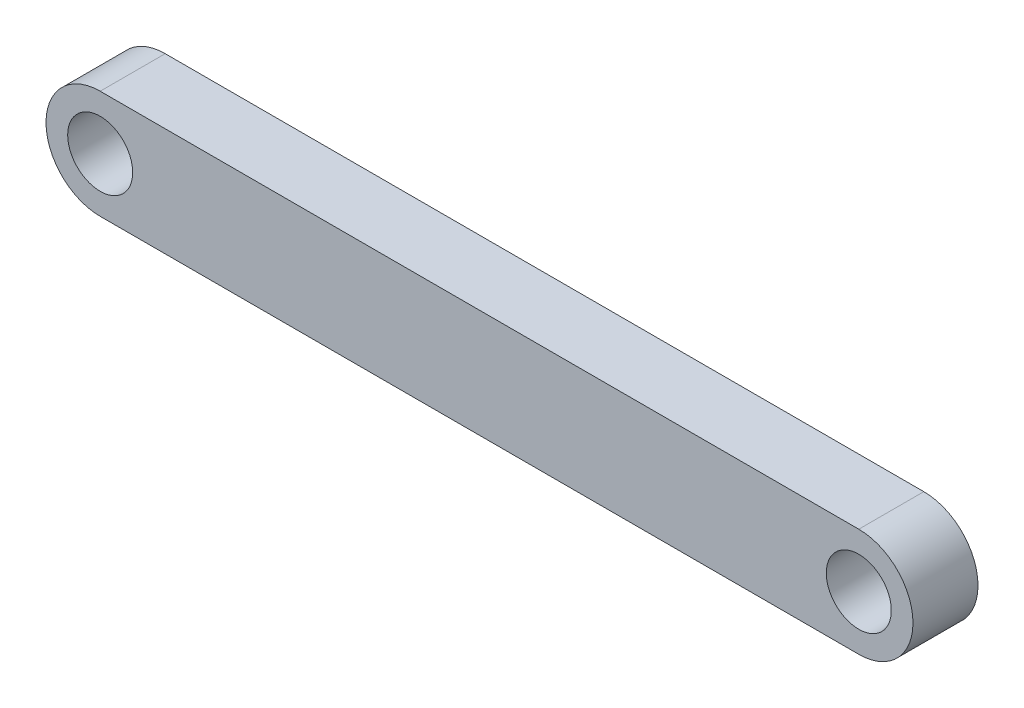
ISO-10303-21;
HEADER;
FILE_DESCRIPTION(('STEP AP214'),'2;1');
FILE_NAME('part.step','',(''),(''),'','','');
FILE_SCHEMA(('AUTOMOTIVE_DESIGN { 1 0 10303 214 1 1 1 1 }'));
ENDSEC;
DATA;
#1=APPLICATION_CONTEXT('core data for automotive mechanical design processes');
#2=APPLICATION_PROTOCOL_DEFINITION('international standard','automotive_design',2000,#1);
#3=PRODUCT_CONTEXT('',#1,'mechanical');
#4=PRODUCT('Part','Part','',(#3));
#5=PRODUCT_RELATED_PRODUCT_CATEGORY('part','',(#4));
#6=PRODUCT_DEFINITION_FORMATION('','',#4);
#7=PRODUCT_DEFINITION_CONTEXT('part definition',#1,'design');
#8=PRODUCT_DEFINITION('design','',#6,#7);
#9=PRODUCT_DEFINITION_SHAPE('','',#8);
#10=(LENGTH_UNIT() NAMED_UNIT(*) SI_UNIT(.MILLI.,.METRE.));
#11=(NAMED_UNIT(*) PLANE_ANGLE_UNIT() SI_UNIT($,.RADIAN.));
#12=(NAMED_UNIT(*) SI_UNIT($,.STERADIAN.) SOLID_ANGLE_UNIT());
#13=UNCERTAINTY_MEASURE_WITH_UNIT(LENGTH_MEASURE(1.E-05),#10,'distance_accuracy_value','');
#14=(GEOMETRIC_REPRESENTATION_CONTEXT(3) GLOBAL_UNCERTAINTY_ASSIGNED_CONTEXT((#13)) GLOBAL_UNIT_ASSIGNED_CONTEXT((#10,
#11,#12)) REPRESENTATION_CONTEXT('',''));
#15=CARTESIAN_POINT('',(0.,0.,0.));
#16=DIRECTION('',(0.,0.,1.));
#17=DIRECTION('',(1.,0.,0.));
#18=AXIS2_PLACEMENT_3D('',#15,#16,#17);
#19=CARTESIAN_POINT('',(70.,670.,9.00000000000001));
#20=DIRECTION('',(0.,0.,-1.));
#21=DIRECTION('',(-1.,0.,0.));
#22=AXIS2_PLACEMENT_3D('',#19,#20,#21);
#23=CYLINDRICAL_SURFACE('',#22,4.99999999999995);
#24=CARTESIAN_POINT('',(70.,670.,3.00000000000001));
#25=DIRECTION('',(0.,0.,-1.));
#26=DIRECTION('',(-1.,0.,0.));
#27=AXIS2_PLACEMENT_3D('',#24,#25,#26);
#28=CIRCLE('',#27,4.99999999999995);
#29=CARTESIAN_POINT('',(70.,675.,3.00000000000001));
#30=VERTEX_POINT('',#29);
#31=CARTESIAN_POINT('',(70.,665.,3.00000000000001));
#32=VERTEX_POINT('',#31);
#33=EDGE_CURVE('E103',#30,#32,#28,.T.);
#34=ORIENTED_EDGE('',*,*,#33,.F.);
#35=DIRECTION('',(0.,0.,-1.));
#36=VECTOR('',#35,1.);
#37=CARTESIAN_POINT('',(70.,675.,9.00000000000001));
#38=LINE('',#37,#36);
#39=CARTESIAN_POINT('',(70.,675.,9.00000000000001));
#40=VERTEX_POINT('',#39);
#41=EDGE_CURVE('E11',#40,#30,#38,.T.);
#42=ORIENTED_EDGE('',*,*,#41,.F.);
#43=CARTESIAN_POINT('',(70.,670.,9.00000000000001));
#44=DIRECTION('',(0.,0.,-1.));
#45=DIRECTION('',(-1.,0.,0.));
#46=AXIS2_PLACEMENT_3D('',#43,#44,#45);
#47=CIRCLE('',#46,4.99999999999995);
#48=CARTESIAN_POINT('',(70.,665.,9.00000000000001));
#49=VERTEX_POINT('',#48);
#50=EDGE_CURVE('E95',#40,#49,#47,.T.);
#51=ORIENTED_EDGE('',*,*,#50,.T.);
#52=DIRECTION('',(0.,0.,-1.));
#53=VECTOR('',#52,1.);
#54=CARTESIAN_POINT('',(70.,665.,9.00000000000001));
#55=LINE('',#54,#53);
#56=EDGE_CURVE('E42',#49,#32,#55,.T.);
#57=ORIENTED_EDGE('',*,*,#56,.T.);
#58=EDGE_LOOP('',(#34,#42,#51,#57));
#59=FACE_BOUND('',#58,.T.);
#60=ADVANCED_FACE('F39',(#59),#23,.T.);
#61=CARTESIAN_POINT('',(1.07057220231712E-12,675.,9.00000000000001));
#62=DIRECTION('',(0.,-1.,0.));
#63=DIRECTION('',(1.,0.,0.));
#64=AXIS2_PLACEMENT_3D('',#61,#62,#63);
#65=PLANE('',#64);
#66=DIRECTION('',(-1.,0.,0.));
#67=VECTOR('',#66,1.);
#68=CARTESIAN_POINT('',(1.07057220231712E-12,675.,3.00000000000001));
#69=LINE('',#68,#67);
#70=CARTESIAN_POINT('',(0.,675.,3.00000000000001));
#71=VERTEX_POINT('',#70);
#72=EDGE_CURVE('E110',#30,#71,#69,.T.);
#73=ORIENTED_EDGE('',*,*,#72,.T.);
#74=DIRECTION('',(0.,0.,-1.));
#75=VECTOR('',#74,1.);
#76=CARTESIAN_POINT('',(0.,675.,9.00000000000001));
#77=LINE('',#76,#75);
#78=CARTESIAN_POINT('',(0.,675.,9.00000000000001));
#79=VERTEX_POINT('',#78);
#80=EDGE_CURVE('E48',#79,#71,#77,.T.);
#81=ORIENTED_EDGE('',*,*,#80,.F.);
#82=DIRECTION('',(-1.,0.,0.));
#83=VECTOR('',#82,1.);
#84=CARTESIAN_POINT('',(1.07057220231712E-12,675.,9.00000000000001));
#85=LINE('',#84,#83);
#86=EDGE_CURVE('E98',#40,#79,#85,.T.);
#87=ORIENTED_EDGE('',*,*,#86,.F.);
#88=ORIENTED_EDGE('',*,*,#41,.T.);
#89=EDGE_LOOP('',(#73,#81,#87,#88));
#90=FACE_BOUND('',#89,.T.);
#91=ADVANCED_FACE('F141',(#90),#65,.F.);
#92=CARTESIAN_POINT('',(0.,670.,9.00000000000001));
#93=DIRECTION('',(0.,0.,-1.));
#94=DIRECTION('',(-1.,0.,0.));
#95=AXIS2_PLACEMENT_3D('',#92,#93,#94);
#96=CYLINDRICAL_SURFACE('',#95,5.);
#97=CARTESIAN_POINT('',(0.,670.,3.00000000000001));
#98=DIRECTION('',(0.,0.,-1.));
#99=DIRECTION('',(-1.,0.,0.));
#100=AXIS2_PLACEMENT_3D('',#97,#98,#99);
#101=CIRCLE('',#100,5.);
#102=CARTESIAN_POINT('',(0.,665.,3.00000000000001));
#103=VERTEX_POINT('',#102);
#104=EDGE_CURVE('E90',#103,#71,#101,.T.);
#105=ORIENTED_EDGE('',*,*,#104,.F.);
#106=DIRECTION('',(0.,0.,-1.));
#107=VECTOR('',#106,1.);
#108=CARTESIAN_POINT('',(0.,665.,9.00000000000001));
#109=LINE('',#108,#107);
#110=CARTESIAN_POINT('',(0.,665.,9.00000000000001));
#111=VERTEX_POINT('',#110);
#112=EDGE_CURVE('E86',#111,#103,#109,.T.);
#113=ORIENTED_EDGE('',*,*,#112,.F.);
#114=CARTESIAN_POINT('',(0.,670.,9.00000000000001));
#115=DIRECTION('',(0.,0.,-1.));
#116=DIRECTION('',(-1.,0.,0.));
#117=AXIS2_PLACEMENT_3D('',#114,#115,#116);
#118=CIRCLE('',#117,5.);
#119=EDGE_CURVE('E88',#111,#79,#118,.T.);
#120=ORIENTED_EDGE('',*,*,#119,.T.);
#121=ORIENTED_EDGE('',*,*,#80,.T.);
#122=EDGE_LOOP('',(#105,#113,#120,#121));
#123=FACE_BOUND('',#122,.T.);
#124=ADVANCED_FACE('F87',(#123),#96,.T.);
#125=CARTESIAN_POINT('',(0.,665.,9.00000000000001));
#126=DIRECTION('',(0.,1.,0.));
#127=DIRECTION('',(0.,0.,1.));
#128=AXIS2_PLACEMENT_3D('',#125,#126,#127);
#129=PLANE('',#128);
#130=DIRECTION('',(1.,0.,0.));
#131=VECTOR('',#130,1.);
#132=CARTESIAN_POINT('',(0.,665.,3.00000000000001));
#133=LINE('',#132,#131);
#134=EDGE_CURVE('E106',#103,#32,#133,.T.);
#135=ORIENTED_EDGE('',*,*,#134,.T.);
#136=ORIENTED_EDGE('',*,*,#56,.F.);
#137=DIRECTION('',(1.,0.,0.));
#138=VECTOR('',#137,1.);
#139=CARTESIAN_POINT('',(0.,665.,9.00000000000001));
#140=LINE('',#139,#138);
#141=EDGE_CURVE('E83',#111,#49,#140,.T.);
#142=ORIENTED_EDGE('',*,*,#141,.F.);
#143=ORIENTED_EDGE('',*,*,#112,.T.);
#144=EDGE_LOOP('',(#135,#136,#142,#143));
#145=FACE_BOUND('',#144,.T.);
#146=ADVANCED_FACE('F94',(#145),#129,.F.);
#147=CARTESIAN_POINT('',(70.,670.,9.00000000000001));
#148=DIRECTION('',(0.,0.,-1.));
#149=DIRECTION('',(-1.,0.,0.));
#150=AXIS2_PLACEMENT_3D('',#147,#148,#149);
#151=PLANE('',#150);
#152=CARTESIAN_POINT('',(70.,670.,9.00000000000001));
#153=DIRECTION('',(0.,0.,-1.));
#154=DIRECTION('',(-1.,0.,0.));
#155=AXIS2_PLACEMENT_3D('',#152,#153,#154);
#156=CIRCLE('',#155,3.00000000000001);
#157=CARTESIAN_POINT('',(67.,670.,9.00000000000001));
#158=VERTEX_POINT('',#157);
#159=EDGE_CURVE('E116',#158,#158,#156,.T.);
#160=ORIENTED_EDGE('',*,*,#159,.T.);
#161=EDGE_LOOP('',(#160));
#162=FACE_BOUND('',#161,.T.);
#163=CARTESIAN_POINT('',(0.,670.,9.00000000000001));
#164=DIRECTION('',(0.,0.,-1.));
#165=DIRECTION('',(-1.,0.,0.));
#166=AXIS2_PLACEMENT_3D('',#163,#164,#165);
#167=CIRCLE('',#166,3.);
#168=CARTESIAN_POINT('',(-3.,670.,9.00000000000001));
#169=VERTEX_POINT('',#168);
#170=EDGE_CURVE('E107',#169,#169,#167,.T.);
#171=ORIENTED_EDGE('',*,*,#170,.T.);
#172=EDGE_LOOP('',(#171));
#173=FACE_BOUND('',#172,.T.);
#174=ORIENTED_EDGE('',*,*,#50,.F.);
#175=ORIENTED_EDGE('',*,*,#86,.T.);
#176=ORIENTED_EDGE('',*,*,#119,.F.);
#177=ORIENTED_EDGE('',*,*,#141,.T.);
#178=EDGE_LOOP('',(#174,#175,#176,#177));
#179=FACE_BOUND('',#178,.T.);
#180=ADVANCED_FACE('F97',(#162,#173,#179),#151,.F.);
#181=CARTESIAN_POINT('',(70.,670.,3.00000000000001));
#182=DIRECTION('',(0.,0.,-1.));
#183=DIRECTION('',(-1.,0.,0.));
#184=AXIS2_PLACEMENT_3D('',#181,#182,#183);
#185=PLANE('',#184);
#186=CARTESIAN_POINT('',(70.,670.,3.00000000000001));
#187=DIRECTION('',(0.,0.,-1.));
#188=DIRECTION('',(-1.,0.,0.));
#189=AXIS2_PLACEMENT_3D('',#186,#187,#188);
#190=CIRCLE('',#189,3.00000000000001);
#191=CARTESIAN_POINT('',(67.,670.,3.00000000000001));
#192=VERTEX_POINT('',#191);
#193=EDGE_CURVE('E119',#192,#192,#190,.T.);
#194=ORIENTED_EDGE('',*,*,#193,.F.);
#195=EDGE_LOOP('',(#194));
#196=FACE_BOUND('',#195,.T.);
#197=CARTESIAN_POINT('',(0.,670.,3.00000000000001));
#198=DIRECTION('',(0.,0.,-1.));
#199=DIRECTION('',(-1.,0.,0.));
#200=AXIS2_PLACEMENT_3D('',#197,#198,#199);
#201=CIRCLE('',#200,3.);
#202=CARTESIAN_POINT('',(-3.,670.,3.00000000000001));
#203=VERTEX_POINT('',#202);
#204=EDGE_CURVE('E113',#203,#203,#201,.T.);
#205=ORIENTED_EDGE('',*,*,#204,.F.);
#206=EDGE_LOOP('',(#205));
#207=FACE_BOUND('',#206,.T.);
#208=ORIENTED_EDGE('',*,*,#33,.T.);
#209=ORIENTED_EDGE('',*,*,#134,.F.);
#210=ORIENTED_EDGE('',*,*,#104,.T.);
#211=ORIENTED_EDGE('',*,*,#72,.F.);
#212=EDGE_LOOP('',(#208,#209,#210,#211));
#213=FACE_BOUND('',#212,.T.);
#214=ADVANCED_FACE('F134',(#196,#207,#213),#185,.T.);
#215=CARTESIAN_POINT('',(0.,670.,9.00000000000001));
#216=DIRECTION('',(0.,0.,-1.));
#217=DIRECTION('',(-1.,0.,0.));
#218=AXIS2_PLACEMENT_3D('',#215,#216,#217);
#219=CYLINDRICAL_SURFACE('',#218,3.);
#220=ORIENTED_EDGE('',*,*,#170,.F.);
#221=EDGE_LOOP('',(#220));
#222=FACE_BOUND('',#221,.T.);
#223=ORIENTED_EDGE('',*,*,#204,.T.);
#224=EDGE_LOOP('',(#223));
#225=FACE_BOUND('',#224,.T.);
#226=ADVANCED_FACE('F130',(#222,#225),#219,.F.);
#227=CARTESIAN_POINT('',(70.,670.,9.00000000000001));
#228=DIRECTION('',(0.,0.,-1.));
#229=DIRECTION('',(-1.,0.,0.));
#230=AXIS2_PLACEMENT_3D('',#227,#228,#229);
#231=CYLINDRICAL_SURFACE('',#230,3.00000000000001);
#232=ORIENTED_EDGE('',*,*,#159,.F.);
#233=EDGE_LOOP('',(#232));
#234=FACE_BOUND('',#233,.T.);
#235=ORIENTED_EDGE('',*,*,#193,.T.);
#236=EDGE_LOOP('',(#235));
#237=FACE_BOUND('',#236,.T.);
#238=ADVANCED_FACE('F127',(#234,#237),#231,.F.);
#239=CLOSED_SHELL('',(#60,#91,#124,#146,#180,#214,#226,#238));
#240=MANIFOLD_SOLID_BREP('B2',#239);
#241=ADVANCED_BREP_SHAPE_REPRESENTATION('',(#18,#240),#14);
#242=SHAPE_DEFINITION_REPRESENTATION(#9,#241);
ENDSEC;
END-ISO-10303-21;
